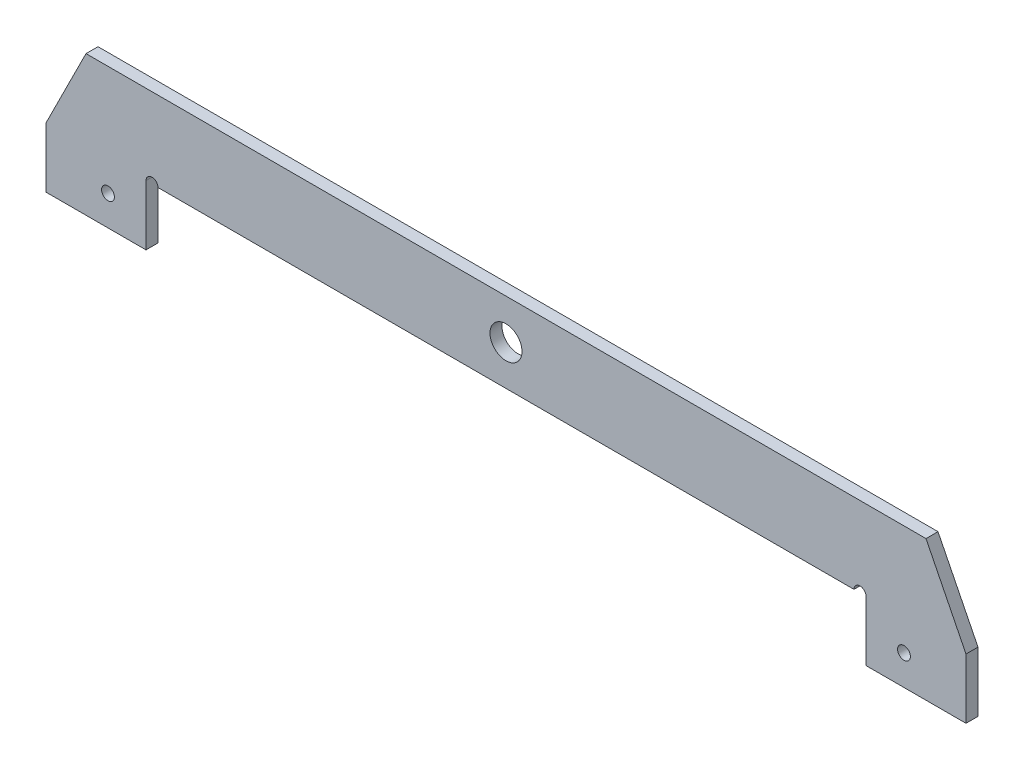
ISO-10303-21;
HEADER;
FILE_DESCRIPTION(('STEP AP214'),'2;1');
FILE_NAME('part.step','',(''),(''),'','','');
FILE_SCHEMA(('AUTOMOTIVE_DESIGN { 1 0 10303 214 1 1 1 1 }'));
ENDSEC;
DATA;
#1=APPLICATION_CONTEXT('core data for automotive mechanical design processes');
#2=APPLICATION_PROTOCOL_DEFINITION('international standard','automotive_design',2000,#1);
#3=PRODUCT_CONTEXT('',#1,'mechanical');
#4=PRODUCT('Part','Part','',(#3));
#5=PRODUCT_RELATED_PRODUCT_CATEGORY('part','',(#4));
#6=PRODUCT_DEFINITION_FORMATION('','',#4);
#7=PRODUCT_DEFINITION_CONTEXT('part definition',#1,'design');
#8=PRODUCT_DEFINITION('design','',#6,#7);
#9=PRODUCT_DEFINITION_SHAPE('','',#8);
#10=(LENGTH_UNIT() NAMED_UNIT(*) SI_UNIT(.MILLI.,.METRE.));
#11=(NAMED_UNIT(*) PLANE_ANGLE_UNIT() SI_UNIT($,.RADIAN.));
#12=(NAMED_UNIT(*) SI_UNIT($,.STERADIAN.) SOLID_ANGLE_UNIT());
#13=UNCERTAINTY_MEASURE_WITH_UNIT(LENGTH_MEASURE(1.E-05),#10,'distance_accuracy_value','');
#14=(GEOMETRIC_REPRESENTATION_CONTEXT(3) GLOBAL_UNCERTAINTY_ASSIGNED_CONTEXT((#13)) GLOBAL_UNIT_ASSIGNED_CONTEXT((#10,
#11,#12)) REPRESENTATION_CONTEXT('',''));
#15=CARTESIAN_POINT('',(0.,0.,0.));
#16=DIRECTION('',(0.,0.,1.));
#17=DIRECTION('',(1.,0.,0.));
#18=AXIS2_PLACEMENT_3D('',#15,#16,#17);
#19=CARTESIAN_POINT('',(0.,0.,3.));
#20=DIRECTION('',(0.,0.,-1.));
#21=DIRECTION('',(-1.,0.,0.));
#22=AXIS2_PLACEMENT_3D('',#19,#20,#21);
#23=PLANE('',#22);
#24=CARTESIAN_POINT('',(99.5,-7.49999999999997,3.));
#25=DIRECTION('',(0.,0.,1.));
#26=DIRECTION('',(-1.,0.,0.));
#27=AXIS2_PLACEMENT_3D('',#24,#25,#26);
#28=CIRCLE('',#27,1.60000000000001);
#29=CARTESIAN_POINT('',(97.9,-7.49999999999997,3.));
#30=VERTEX_POINT('',#29);
#31=EDGE_CURVE('E303',#30,#30,#28,.T.);
#32=ORIENTED_EDGE('',*,*,#31,.F.);
#33=EDGE_LOOP('',(#32));
#34=FACE_BOUND('',#33,.T.);
#35=CARTESIAN_POINT('',(-99.5,-7.5,3.));
#36=DIRECTION('',(0.,0.,1.));
#37=DIRECTION('',(1.,0.,0.));
#38=AXIS2_PLACEMENT_3D('',#35,#36,#37);
#39=CIRCLE('',#38,1.60000000000001);
#40=CARTESIAN_POINT('',(-97.9,-7.5,3.));
#41=VERTEX_POINT('',#40);
#42=EDGE_CURVE('E152',#41,#41,#39,.T.);
#43=ORIENTED_EDGE('',*,*,#42,.F.);
#44=EDGE_LOOP('',(#43));
#45=FACE_BOUND('',#44,.T.);
#46=DIRECTION('',(1.,0.,0.));
#47=VECTOR('',#46,1.);
#48=CARTESIAN_POINT('',(90.,0.,3.));
#49=LINE('',#48,#47);
#50=CARTESIAN_POINT('',(-87.,0.,3.));
#51=VERTEX_POINT('',#50);
#52=CARTESIAN_POINT('',(87.,0.,3.));
#53=VERTEX_POINT('',#52);
#54=EDGE_CURVE('E284',#51,#53,#49,.T.);
#55=ORIENTED_EDGE('',*,*,#54,.T.);
#56=CARTESIAN_POINT('',(88.5,0.,3.));
#57=DIRECTION('',(0.,0.,1.));
#58=DIRECTION('',(1.,0.,0.));
#59=AXIS2_PLACEMENT_3D('',#56,#57,#58);
#60=CIRCLE('',#59,1.5);
#61=CARTESIAN_POINT('',(90.,0.,3.));
#62=VERTEX_POINT('',#61);
#63=EDGE_CURVE('E259',#62,#53,#60,.T.);
#64=ORIENTED_EDGE('',*,*,#63,.F.);
#65=DIRECTION('',(0.,-1.,0.));
#66=VECTOR('',#65,1.);
#67=CARTESIAN_POINT('',(90.,0.,3.));
#68=LINE('',#67,#66);
#69=CARTESIAN_POINT('',(90.,-15.,3.));
#70=VERTEX_POINT('',#69);
#71=EDGE_CURVE('E102',#62,#70,#68,.T.);
#72=ORIENTED_EDGE('',*,*,#71,.T.);
#73=DIRECTION('',(1.,0.,0.));
#74=VECTOR('',#73,1.);
#75=CARTESIAN_POINT('',(90.,-15.,3.));
#76=LINE('',#75,#74);
#77=CARTESIAN_POINT('',(115.,-15.,3.));
#78=VERTEX_POINT('',#77);
#79=EDGE_CURVE('E159',#70,#78,#76,.T.);
#80=ORIENTED_EDGE('',*,*,#79,.T.);
#81=DIRECTION('',(0.,1.,0.));
#82=VECTOR('',#81,1.);
#83=CARTESIAN_POINT('',(115.,0.,3.));
#84=LINE('',#83,#82);
#85=CARTESIAN_POINT('',(115.,0.,3.));
#86=VERTEX_POINT('',#85);
#87=EDGE_CURVE('E155',#78,#86,#84,.T.);
#88=ORIENTED_EDGE('',*,*,#87,.T.);
#89=DIRECTION('',(-0.447213595499959,0.894427190999915,0.));
#90=VECTOR('',#89,1.);
#91=CARTESIAN_POINT('',(115.,0.,3.));
#92=LINE('',#91,#90);
#93=CARTESIAN_POINT('',(105.,20.,3.));
#94=VERTEX_POINT('',#93);
#95=EDGE_CURVE('E140',#86,#94,#92,.T.);
#96=ORIENTED_EDGE('',*,*,#95,.T.);
#97=DIRECTION('',(-1.,0.,0.));
#98=VECTOR('',#97,1.);
#99=CARTESIAN_POINT('',(-105.,20.,3.));
#100=LINE('',#99,#98);
#101=CARTESIAN_POINT('',(-105.,20.,3.));
#102=VERTEX_POINT('',#101);
#103=EDGE_CURVE('E164',#94,#102,#100,.T.);
#104=ORIENTED_EDGE('',*,*,#103,.T.);
#105=DIRECTION('',(-0.447213595499958,-0.894427190999916,0.));
#106=VECTOR('',#105,1.);
#107=CARTESIAN_POINT('',(-115.,0.,3.));
#108=LINE('',#107,#106);
#109=CARTESIAN_POINT('',(-115.,0.,3.));
#110=VERTEX_POINT('',#109);
#111=EDGE_CURVE('E253',#102,#110,#108,.T.);
#112=ORIENTED_EDGE('',*,*,#111,.T.);
#113=DIRECTION('',(0.,-1.,0.));
#114=VECTOR('',#113,1.);
#115=CARTESIAN_POINT('',(-115.,0.,3.));
#116=LINE('',#115,#114);
#117=CARTESIAN_POINT('',(-115.,-15.,3.));
#118=VERTEX_POINT('',#117);
#119=EDGE_CURVE('E301',#110,#118,#116,.T.);
#120=ORIENTED_EDGE('',*,*,#119,.T.);
#121=DIRECTION('',(1.,0.,0.));
#122=VECTOR('',#121,1.);
#123=CARTESIAN_POINT('',(-90.,-15.,3.));
#124=LINE('',#123,#122);
#125=CARTESIAN_POINT('',(-90.,-15.,3.));
#126=VERTEX_POINT('',#125);
#127=EDGE_CURVE('E65',#118,#126,#124,.T.);
#128=ORIENTED_EDGE('',*,*,#127,.T.);
#129=DIRECTION('',(0.,1.,0.));
#130=VECTOR('',#129,1.);
#131=CARTESIAN_POINT('',(-90.,0.,3.));
#132=LINE('',#131,#130);
#133=CARTESIAN_POINT('',(-90.,0.,3.));
#134=VERTEX_POINT('',#133);
#135=EDGE_CURVE('E237',#126,#134,#132,.T.);
#136=ORIENTED_EDGE('',*,*,#135,.T.);
#137=CARTESIAN_POINT('',(-88.5,0.,3.));
#138=DIRECTION('',(0.,0.,1.));
#139=DIRECTION('',(1.,0.,0.));
#140=AXIS2_PLACEMENT_3D('',#137,#138,#139);
#141=CIRCLE('',#140,1.5);
#142=EDGE_CURVE('E193',#51,#134,#141,.T.);
#143=ORIENTED_EDGE('',*,*,#142,.F.);
#144=EDGE_LOOP('',(#55,#64,#72,#80,#88,#96,#104,#112,#120,#128,#136,#143));
#145=FACE_BOUND('',#144,.T.);
#146=CARTESIAN_POINT('',(0.,9.99999999999998,3.));
#147=DIRECTION('',(0.,0.,1.));
#148=DIRECTION('',(1.,0.,0.));
#149=AXIS2_PLACEMENT_3D('',#146,#147,#148);
#150=CIRCLE('',#149,4.);
#151=CARTESIAN_POINT('',(4.00000000000001,9.99999999999998,3.));
#152=VERTEX_POINT('',#151);
#153=EDGE_CURVE('E211',#152,#152,#150,.T.);
#154=ORIENTED_EDGE('',*,*,#153,.F.);
#155=EDGE_LOOP('',(#154));
#156=FACE_BOUND('',#155,.T.);
#157=ADVANCED_FACE('F41',(#34,#45,#145,#156),#23,.F.);
#158=CARTESIAN_POINT('',(0.,0.,0.));
#159=DIRECTION('',(0.,0.,-1.));
#160=DIRECTION('',(-1.,0.,0.));
#161=AXIS2_PLACEMENT_3D('',#158,#159,#160);
#162=PLANE('',#161);
#163=CARTESIAN_POINT('',(99.5,-7.49999999999997,0.));
#164=DIRECTION('',(0.,0.,-1.));
#165=DIRECTION('',(-1.,0.,0.));
#166=AXIS2_PLACEMENT_3D('',#163,#164,#165);
#167=CIRCLE('',#166,1.60000000000001);
#168=CARTESIAN_POINT('',(97.9,-7.49999999999997,0.));
#169=VERTEX_POINT('',#168);
#170=EDGE_CURVE('E306',#169,#169,#167,.F.);
#171=ORIENTED_EDGE('',*,*,#170,.T.);
#172=EDGE_LOOP('',(#171));
#173=FACE_BOUND('',#172,.T.);
#174=CARTESIAN_POINT('',(-99.5,-7.5,0.));
#175=DIRECTION('',(0.,0.,-1.));
#176=DIRECTION('',(-1.,0.,0.));
#177=AXIS2_PLACEMENT_3D('',#174,#175,#176);
#178=CIRCLE('',#177,1.60000000000001);
#179=CARTESIAN_POINT('',(-101.1,-7.5,0.));
#180=VERTEX_POINT('',#179);
#181=EDGE_CURVE('E297',#180,#180,#178,.F.);
#182=ORIENTED_EDGE('',*,*,#181,.T.);
#183=EDGE_LOOP('',(#182));
#184=FACE_BOUND('',#183,.T.);
#185=CARTESIAN_POINT('',(88.5,0.,0.));
#186=DIRECTION('',(0.,0.,1.));
#187=DIRECTION('',(1.,0.,0.));
#188=AXIS2_PLACEMENT_3D('',#185,#186,#187);
#189=CIRCLE('',#188,1.5);
#190=CARTESIAN_POINT('',(90.,0.,0.));
#191=VERTEX_POINT('',#190);
#192=CARTESIAN_POINT('',(87.,0.,0.));
#193=VERTEX_POINT('',#192);
#194=EDGE_CURVE('E263',#191,#193,#189,.T.);
#195=ORIENTED_EDGE('',*,*,#194,.T.);
#196=DIRECTION('',(1.,0.,0.));
#197=VECTOR('',#196,1.);
#198=CARTESIAN_POINT('',(90.,0.,0.));
#199=LINE('',#198,#197);
#200=CARTESIAN_POINT('',(-86.9999999999999,0.,0.));
#201=VERTEX_POINT('',#200);
#202=EDGE_CURVE('E205',#201,#193,#199,.T.);
#203=ORIENTED_EDGE('',*,*,#202,.F.);
#204=CARTESIAN_POINT('',(-88.5,0.,0.));
#205=DIRECTION('',(0.,0.,1.));
#206=DIRECTION('',(1.,0.,0.));
#207=AXIS2_PLACEMENT_3D('',#204,#205,#206);
#208=CIRCLE('',#207,1.5);
#209=CARTESIAN_POINT('',(-90.,0.,0.));
#210=VERTEX_POINT('',#209);
#211=EDGE_CURVE('E57',#201,#210,#208,.T.);
#212=ORIENTED_EDGE('',*,*,#211,.T.);
#213=DIRECTION('',(0.,1.,0.));
#214=VECTOR('',#213,1.);
#215=CARTESIAN_POINT('',(-90.,0.,0.));
#216=LINE('',#215,#214);
#217=CARTESIAN_POINT('',(-90.,-15.,0.));
#218=VERTEX_POINT('',#217);
#219=EDGE_CURVE('E203',#218,#210,#216,.T.);
#220=ORIENTED_EDGE('',*,*,#219,.F.);
#221=DIRECTION('',(1.,0.,0.));
#222=VECTOR('',#221,1.);
#223=CARTESIAN_POINT('',(-90.,-15.,0.));
#224=LINE('',#223,#222);
#225=CARTESIAN_POINT('',(-115.,-15.,0.));
#226=VERTEX_POINT('',#225);
#227=EDGE_CURVE('E95',#226,#218,#224,.T.);
#228=ORIENTED_EDGE('',*,*,#227,.F.);
#229=DIRECTION('',(0.,-1.,0.));
#230=VECTOR('',#229,1.);
#231=CARTESIAN_POINT('',(-115.,0.,0.));
#232=LINE('',#231,#230);
#233=CARTESIAN_POINT('',(-115.,0.,0.));
#234=VERTEX_POINT('',#233);
#235=EDGE_CURVE('E233',#234,#226,#232,.T.);
#236=ORIENTED_EDGE('',*,*,#235,.F.);
#237=DIRECTION('',(-0.447213595499958,-0.894427190999916,0.));
#238=VECTOR('',#237,1.);
#239=CARTESIAN_POINT('',(-115.,0.,0.));
#240=LINE('',#239,#238);
#241=CARTESIAN_POINT('',(-105.,20.,0.));
#242=VERTEX_POINT('',#241);
#243=EDGE_CURVE('E251',#242,#234,#240,.T.);
#244=ORIENTED_EDGE('',*,*,#243,.F.);
#245=DIRECTION('',(-1.,0.,0.));
#246=VECTOR('',#245,1.);
#247=CARTESIAN_POINT('',(-105.,20.,0.));
#248=LINE('',#247,#246);
#249=CARTESIAN_POINT('',(105.,20.,0.));
#250=VERTEX_POINT('',#249);
#251=EDGE_CURVE('E229',#250,#242,#248,.T.);
#252=ORIENTED_EDGE('',*,*,#251,.F.);
#253=DIRECTION('',(-0.447213595499959,0.894427190999915,0.));
#254=VECTOR('',#253,1.);
#255=CARTESIAN_POINT('',(115.,0.,0.));
#256=LINE('',#255,#254);
#257=CARTESIAN_POINT('',(115.,0.,0.));
#258=VERTEX_POINT('',#257);
#259=EDGE_CURVE('E151',#258,#250,#256,.T.);
#260=ORIENTED_EDGE('',*,*,#259,.F.);
#261=DIRECTION('',(0.,1.,0.));
#262=VECTOR('',#261,1.);
#263=CARTESIAN_POINT('',(115.,0.,0.));
#264=LINE('',#263,#262);
#265=CARTESIAN_POINT('',(115.,-15.,0.));
#266=VERTEX_POINT('',#265);
#267=EDGE_CURVE('E168',#266,#258,#264,.T.);
#268=ORIENTED_EDGE('',*,*,#267,.F.);
#269=DIRECTION('',(1.,0.,0.));
#270=VECTOR('',#269,1.);
#271=CARTESIAN_POINT('',(90.,-15.,0.));
#272=LINE('',#271,#270);
#273=CARTESIAN_POINT('',(90.,-15.,0.));
#274=VERTEX_POINT('',#273);
#275=EDGE_CURVE('E225',#274,#266,#272,.T.);
#276=ORIENTED_EDGE('',*,*,#275,.F.);
#277=DIRECTION('',(0.,-1.,0.));
#278=VECTOR('',#277,1.);
#279=CARTESIAN_POINT('',(90.,0.,0.));
#280=LINE('',#279,#278);
#281=EDGE_CURVE('E215',#191,#274,#280,.T.);
#282=ORIENTED_EDGE('',*,*,#281,.F.);
#283=EDGE_LOOP('',(#195,#203,#212,#220,#228,#236,#244,#252,#260,#268,#276,#282));
#284=FACE_BOUND('',#283,.T.);
#285=CARTESIAN_POINT('',(0.,9.99999999999998,0.));
#286=DIRECTION('',(0.,0.,1.));
#287=DIRECTION('',(1.,0.,0.));
#288=AXIS2_PLACEMENT_3D('',#285,#286,#287);
#289=CIRCLE('',#288,4.);
#290=CARTESIAN_POINT('',(4.00000000000001,9.99999999999998,0.));
#291=VERTEX_POINT('',#290);
#292=EDGE_CURVE('E207',#291,#291,#289,.T.);
#293=ORIENTED_EDGE('',*,*,#292,.T.);
#294=EDGE_LOOP('',(#293));
#295=FACE_BOUND('',#294,.T.);
#296=ADVANCED_FACE('F201',(#173,#184,#284,#295),#162,.T.);
#297=CARTESIAN_POINT('',(-90.,0.,3.));
#298=DIRECTION('',(-1.,0.,0.));
#299=DIRECTION('',(0.,-1.,0.));
#300=AXIS2_PLACEMENT_3D('',#297,#298,#299);
#301=PLANE('',#300);
#302=ORIENTED_EDGE('',*,*,#219,.T.);
#303=DIRECTION('',(0.,0.,-1.));
#304=VECTOR('',#303,1.);
#305=CARTESIAN_POINT('',(-90.,0.,3.));
#306=LINE('',#305,#304);
#307=EDGE_CURVE('E50',#134,#210,#306,.T.);
#308=ORIENTED_EDGE('',*,*,#307,.F.);
#309=ORIENTED_EDGE('',*,*,#135,.F.);
#310=DIRECTION('',(0.,0.,-1.));
#311=VECTOR('',#310,1.);
#312=CARTESIAN_POINT('',(-90.,-15.,3.));
#313=LINE('',#312,#311);
#314=EDGE_CURVE('E209',#126,#218,#313,.T.);
#315=ORIENTED_EDGE('',*,*,#314,.T.);
#316=EDGE_LOOP('',(#302,#308,#309,#315));
#317=FACE_BOUND('',#316,.T.);
#318=ADVANCED_FACE('F43',(#317),#301,.F.);
#319=CARTESIAN_POINT('',(90.,0.,3.));
#320=DIRECTION('',(0.,1.,0.));
#321=DIRECTION('',(-1.,0.,0.));
#322=AXIS2_PLACEMENT_3D('',#319,#320,#321);
#323=PLANE('',#322);
#324=ORIENTED_EDGE('',*,*,#202,.T.);
#325=DIRECTION('',(0.,0.,1.));
#326=VECTOR('',#325,1.);
#327=CARTESIAN_POINT('',(87.,0.,0.));
#328=LINE('',#327,#326);
#329=EDGE_CURVE('E270',#193,#53,#328,.T.);
#330=ORIENTED_EDGE('',*,*,#329,.T.);
#331=ORIENTED_EDGE('',*,*,#54,.F.);
#332=DIRECTION('',(0.,0.,1.));
#333=VECTOR('',#332,1.);
#334=CARTESIAN_POINT('',(-87.,0.,0.));
#335=LINE('',#334,#333);
#336=EDGE_CURVE('E12',#51,#201,#335,.F.);
#337=ORIENTED_EDGE('',*,*,#336,.T.);
#338=EDGE_LOOP('',(#324,#330,#331,#337));
#339=FACE_BOUND('',#338,.T.);
#340=ADVANCED_FACE('F326',(#339),#323,.F.);
#341=CARTESIAN_POINT('',(90.,0.,3.));
#342=DIRECTION('',(1.,0.,0.));
#343=DIRECTION('',(0.,1.,0.));
#344=AXIS2_PLACEMENT_3D('',#341,#342,#343);
#345=PLANE('',#344);
#346=ORIENTED_EDGE('',*,*,#281,.T.);
#347=DIRECTION('',(0.,0.,-1.));
#348=VECTOR('',#347,1.);
#349=CARTESIAN_POINT('',(90.,-15.,3.));
#350=LINE('',#349,#348);
#351=EDGE_CURVE('E175',#70,#274,#350,.T.);
#352=ORIENTED_EDGE('',*,*,#351,.F.);
#353=ORIENTED_EDGE('',*,*,#71,.F.);
#354=DIRECTION('',(0.,0.,-1.));
#355=VECTOR('',#354,1.);
#356=CARTESIAN_POINT('',(90.,0.,3.));
#357=LINE('',#356,#355);
#358=EDGE_CURVE('E185',#62,#191,#357,.T.);
#359=ORIENTED_EDGE('',*,*,#358,.T.);
#360=EDGE_LOOP('',(#346,#352,#353,#359));
#361=FACE_BOUND('',#360,.T.);
#362=ADVANCED_FACE('F329',(#361),#345,.F.);
#363=CARTESIAN_POINT('',(90.,-15.,3.));
#364=DIRECTION('',(0.,1.,0.));
#365=DIRECTION('',(-1.,0.,0.));
#366=AXIS2_PLACEMENT_3D('',#363,#364,#365);
#367=PLANE('',#366);
#368=ORIENTED_EDGE('',*,*,#275,.T.);
#369=DIRECTION('',(0.,0.,-1.));
#370=VECTOR('',#369,1.);
#371=CARTESIAN_POINT('',(115.,-15.,3.));
#372=LINE('',#371,#370);
#373=EDGE_CURVE('E170',#78,#266,#372,.T.);
#374=ORIENTED_EDGE('',*,*,#373,.F.);
#375=ORIENTED_EDGE('',*,*,#79,.F.);
#376=ORIENTED_EDGE('',*,*,#351,.T.);
#377=EDGE_LOOP('',(#368,#374,#375,#376));
#378=FACE_BOUND('',#377,.T.);
#379=ADVANCED_FACE('F333',(#378),#367,.F.);
#380=CARTESIAN_POINT('',(115.,0.,3.));
#381=DIRECTION('',(-1.,0.,0.));
#382=DIRECTION('',(0.,0.,1.));
#383=AXIS2_PLACEMENT_3D('',#380,#381,#382);
#384=PLANE('',#383);
#385=ORIENTED_EDGE('',*,*,#267,.T.);
#386=DIRECTION('',(0.,0.,-1.));
#387=VECTOR('',#386,1.);
#388=CARTESIAN_POINT('',(115.,0.,3.));
#389=LINE('',#388,#387);
#390=EDGE_CURVE('E144',#86,#258,#389,.T.);
#391=ORIENTED_EDGE('',*,*,#390,.F.);
#392=ORIENTED_EDGE('',*,*,#87,.F.);
#393=ORIENTED_EDGE('',*,*,#373,.T.);
#394=EDGE_LOOP('',(#385,#391,#392,#393));
#395=FACE_BOUND('',#394,.T.);
#396=ADVANCED_FACE('F166',(#395),#384,.F.);
#397=CARTESIAN_POINT('',(-105.,20.,3.));
#398=DIRECTION('',(0.,-1.,0.));
#399=DIRECTION('',(1.,0.,0.));
#400=AXIS2_PLACEMENT_3D('',#397,#398,#399);
#401=PLANE('',#400);
#402=ORIENTED_EDGE('',*,*,#251,.T.);
#403=DIRECTION('',(0.,0.,-1.));
#404=VECTOR('',#403,1.);
#405=CARTESIAN_POINT('',(-105.,20.,3.));
#406=LINE('',#405,#404);
#407=EDGE_CURVE('E178',#102,#242,#406,.T.);
#408=ORIENTED_EDGE('',*,*,#407,.F.);
#409=ORIENTED_EDGE('',*,*,#103,.F.);
#410=DIRECTION('',(0.,0.,-1.));
#411=VECTOR('',#410,1.);
#412=CARTESIAN_POINT('',(105.,20.,3.));
#413=LINE('',#412,#411);
#414=EDGE_CURVE('E147',#94,#250,#413,.T.);
#415=ORIENTED_EDGE('',*,*,#414,.T.);
#416=EDGE_LOOP('',(#402,#408,#409,#415));
#417=FACE_BOUND('',#416,.T.);
#418=ADVANCED_FACE('F256',(#417),#401,.F.);
#419=CARTESIAN_POINT('',(-115.,0.,3.));
#420=DIRECTION('',(1.,0.,0.));
#421=DIRECTION('',(0.,0.,-1.));
#422=AXIS2_PLACEMENT_3D('',#419,#420,#421);
#423=PLANE('',#422);
#424=ORIENTED_EDGE('',*,*,#235,.T.);
#425=DIRECTION('',(0.,0.,-1.));
#426=VECTOR('',#425,1.);
#427=CARTESIAN_POINT('',(-115.,-15.,3.));
#428=LINE('',#427,#426);
#429=EDGE_CURVE('E240',#118,#226,#428,.T.);
#430=ORIENTED_EDGE('',*,*,#429,.F.);
#431=ORIENTED_EDGE('',*,*,#119,.F.);
#432=DIRECTION('',(0.,0.,-1.));
#433=VECTOR('',#432,1.);
#434=CARTESIAN_POINT('',(-115.,0.,3.));
#435=LINE('',#434,#433);
#436=EDGE_CURVE('E243',#110,#234,#435,.T.);
#437=ORIENTED_EDGE('',*,*,#436,.T.);
#438=EDGE_LOOP('',(#424,#430,#431,#437));
#439=FACE_BOUND('',#438,.T.);
#440=ADVANCED_FACE('F359',(#439),#423,.F.);
#441=CARTESIAN_POINT('',(-90.,-15.,3.));
#442=DIRECTION('',(0.,1.,0.));
#443=DIRECTION('',(0.,0.,1.));
#444=AXIS2_PLACEMENT_3D('',#441,#442,#443);
#445=PLANE('',#444);
#446=ORIENTED_EDGE('',*,*,#227,.T.);
#447=ORIENTED_EDGE('',*,*,#314,.F.);
#448=ORIENTED_EDGE('',*,*,#127,.F.);
#449=ORIENTED_EDGE('',*,*,#429,.T.);
#450=EDGE_LOOP('',(#446,#447,#448,#449));
#451=FACE_BOUND('',#450,.T.);
#452=ADVANCED_FACE('F356',(#451),#445,.F.);
#453=CARTESIAN_POINT('',(0.,9.99999999999998,3.));
#454=DIRECTION('',(0.,0.,-1.));
#455=DIRECTION('',(-1.,0.,0.));
#456=AXIS2_PLACEMENT_3D('',#453,#454,#455);
#457=CYLINDRICAL_SURFACE('',#456,4.);
#458=ORIENTED_EDGE('',*,*,#153,.T.);
#459=EDGE_LOOP('',(#458));
#460=FACE_BOUND('',#459,.T.);
#461=ORIENTED_EDGE('',*,*,#292,.F.);
#462=EDGE_LOOP('',(#461));
#463=FACE_BOUND('',#462,.T.);
#464=ADVANCED_FACE('F342',(#460,#463),#457,.F.);
#465=CARTESIAN_POINT('',(-88.5,0.,0.));
#466=DIRECTION('',(0.,0.,1.));
#467=DIRECTION('',(1.,0.,0.));
#468=AXIS2_PLACEMENT_3D('',#465,#466,#467);
#469=CYLINDRICAL_SURFACE('',#468,1.5);
#470=ORIENTED_EDGE('',*,*,#211,.F.);
#471=ORIENTED_EDGE('',*,*,#336,.F.);
#472=ORIENTED_EDGE('',*,*,#142,.T.);
#473=ORIENTED_EDGE('',*,*,#307,.T.);
#474=EDGE_LOOP('',(#470,#471,#472,#473));
#475=FACE_BOUND('',#474,.T.);
#476=ADVANCED_FACE('F191',(#475),#469,.F.);
#477=CARTESIAN_POINT('',(88.5,0.,0.));
#478=DIRECTION('',(0.,0.,1.));
#479=DIRECTION('',(1.,0.,0.));
#480=AXIS2_PLACEMENT_3D('',#477,#478,#479);
#481=CYLINDRICAL_SURFACE('',#480,1.5);
#482=ORIENTED_EDGE('',*,*,#194,.F.);
#483=ORIENTED_EDGE('',*,*,#358,.F.);
#484=ORIENTED_EDGE('',*,*,#63,.T.);
#485=ORIENTED_EDGE('',*,*,#329,.F.);
#486=EDGE_LOOP('',(#482,#483,#484,#485));
#487=FACE_BOUND('',#486,.T.);
#488=ADVANCED_FACE('F334',(#487),#481,.F.);
#489=CARTESIAN_POINT('',(-115.,0.,-22.3606797749979));
#490=DIRECTION('',(-0.894427190999916,0.447213595499958,0.));
#491=DIRECTION('',(-0.447213595499958,-0.894427190999916,0.));
#492=AXIS2_PLACEMENT_3D('',#489,#490,#491);
#493=PLANE('',#492);
#494=ORIENTED_EDGE('',*,*,#407,.T.);
#495=ORIENTED_EDGE('',*,*,#243,.T.);
#496=ORIENTED_EDGE('',*,*,#436,.F.);
#497=ORIENTED_EDGE('',*,*,#111,.F.);
#498=EDGE_LOOP('',(#494,#495,#496,#497));
#499=FACE_BOUND('',#498,.T.);
#500=ADVANCED_FACE('F250',(#499),#493,.T.);
#501=CARTESIAN_POINT('',(115.,0.,-22.3606797749979));
#502=DIRECTION('',(0.894427190999915,0.447213595499959,0.));
#503=DIRECTION('',(-0.447213595499959,0.894427190999915,0.));
#504=AXIS2_PLACEMENT_3D('',#501,#502,#503);
#505=PLANE('',#504);
#506=ORIENTED_EDGE('',*,*,#390,.T.);
#507=ORIENTED_EDGE('',*,*,#259,.T.);
#508=ORIENTED_EDGE('',*,*,#414,.F.);
#509=ORIENTED_EDGE('',*,*,#95,.F.);
#510=EDGE_LOOP('',(#506,#507,#508,#509));
#511=FACE_BOUND('',#510,.T.);
#512=ADVANCED_FACE('F142',(#511),#505,.T.);
#513=CARTESIAN_POINT('',(-99.5,-7.5,-0.00100000000000013));
#514=DIRECTION('',(0.,0.,1.));
#515=DIRECTION('',(1.,0.,0.));
#516=AXIS2_PLACEMENT_3D('',#513,#514,#515);
#517=CYLINDRICAL_SURFACE('',#516,1.60000000000001);
#518=ORIENTED_EDGE('',*,*,#181,.F.);
#519=EDGE_LOOP('',(#518));
#520=FACE_BOUND('',#519,.T.);
#521=ORIENTED_EDGE('',*,*,#42,.T.);
#522=EDGE_LOOP('',(#521));
#523=FACE_BOUND('',#522,.T.);
#524=ADVANCED_FACE('F396',(#520,#523),#517,.F.);
#525=CARTESIAN_POINT('',(99.5,-7.49999999999997,-0.00100000000000013));
#526=DIRECTION('',(0.,0.,1.));
#527=DIRECTION('',(1.,0.,0.));
#528=AXIS2_PLACEMENT_3D('',#525,#526,#527);
#529=CYLINDRICAL_SURFACE('',#528,1.60000000000001);
#530=ORIENTED_EDGE('',*,*,#170,.F.);
#531=EDGE_LOOP('',(#530));
#532=FACE_BOUND('',#531,.T.);
#533=ORIENTED_EDGE('',*,*,#31,.T.);
#534=EDGE_LOOP('',(#533));
#535=FACE_BOUND('',#534,.T.);
#536=ADVANCED_FACE('F501',(#532,#535),#529,.F.);
#537=CLOSED_SHELL('',(#157,#296,#318,#340,#362,#379,#396,#418,#440,#452,#464,#476,#488,#500,
#512,#524,#536));
#538=MANIFOLD_SOLID_BREP('B2',#537);
#539=ADVANCED_BREP_SHAPE_REPRESENTATION('',(#18,#538),#14);
#540=SHAPE_DEFINITION_REPRESENTATION(#9,#539);
ENDSEC;
END-ISO-10303-21;
